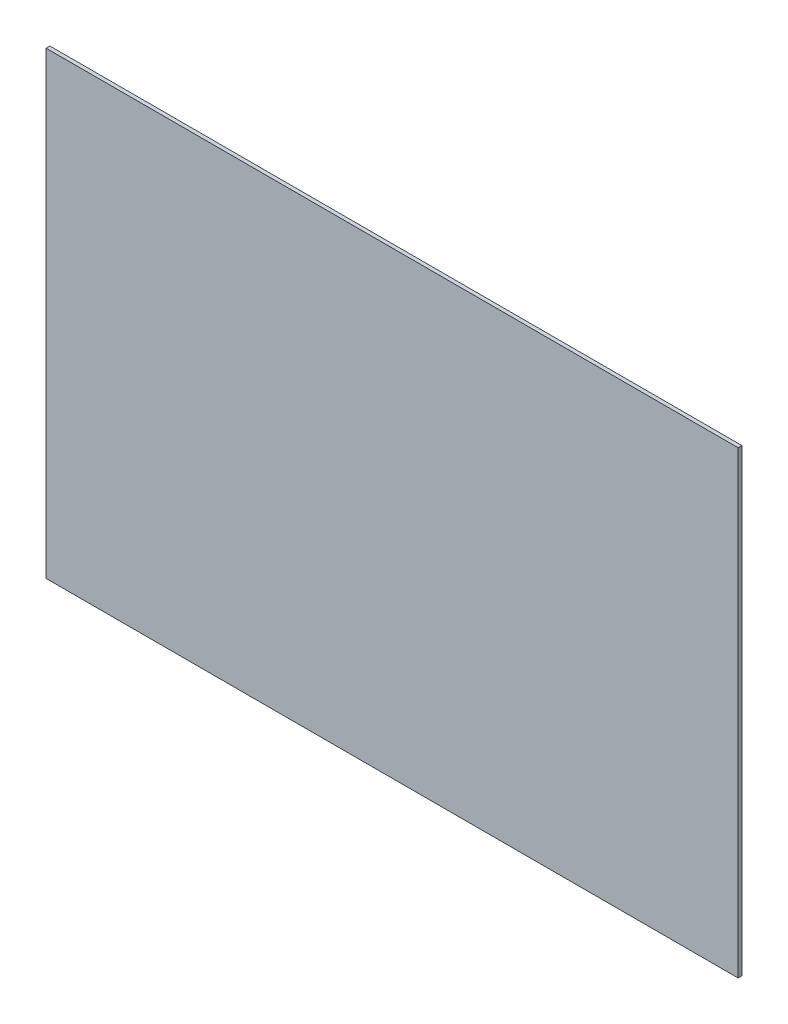
ISO-10303-21;
HEADER;
FILE_DESCRIPTION(('STEP AP214'),'2;1');
FILE_NAME('part.step','',(''),(''),'','','');
FILE_SCHEMA(('AUTOMOTIVE_DESIGN { 1 0 10303 214 1 1 1 1 }'));
ENDSEC;
DATA;
#1=APPLICATION_CONTEXT('core data for automotive mechanical design processes');
#2=APPLICATION_PROTOCOL_DEFINITION('international standard','automotive_design',2000,#1);
#3=PRODUCT_CONTEXT('',#1,'mechanical');
#4=PRODUCT('Part','Part','',(#3));
#5=PRODUCT_RELATED_PRODUCT_CATEGORY('part','',(#4));
#6=PRODUCT_DEFINITION_FORMATION('','',#4);
#7=PRODUCT_DEFINITION_CONTEXT('part definition',#1,'design');
#8=PRODUCT_DEFINITION('design','',#6,#7);
#9=PRODUCT_DEFINITION_SHAPE('','',#8);
#10=(LENGTH_UNIT() NAMED_UNIT(*) SI_UNIT(.MILLI.,.METRE.));
#11=(NAMED_UNIT(*) PLANE_ANGLE_UNIT() SI_UNIT($,.RADIAN.));
#12=(NAMED_UNIT(*) SI_UNIT($,.STERADIAN.) SOLID_ANGLE_UNIT());
#13=UNCERTAINTY_MEASURE_WITH_UNIT(LENGTH_MEASURE(1.E-05),#10,'distance_accuracy_value','');
#14=(GEOMETRIC_REPRESENTATION_CONTEXT(3) GLOBAL_UNCERTAINTY_ASSIGNED_CONTEXT((#13)) GLOBAL_UNIT_ASSIGNED_CONTEXT((#10,
#11,#12)) REPRESENTATION_CONTEXT('',''));
#15=CARTESIAN_POINT('',(0.,0.,0.));
#16=DIRECTION('',(0.,0.,1.));
#17=DIRECTION('',(1.,0.,0.));
#18=AXIS2_PLACEMENT_3D('',#15,#16,#17);
#19=CARTESIAN_POINT('',(-201.936102236422,140.923322683706,3.));
#20=DIRECTION('',(1.,0.,0.));
#21=DIRECTION('',(0.,1.,0.));
#22=AXIS2_PLACEMENT_3D('',#19,#20,#21);
#23=PLANE('',#22);
#24=DIRECTION('',(0.,-1.,0.));
#25=VECTOR('',#24,1.);
#26=CARTESIAN_POINT('',(-201.936102236422,140.923322683706,0.));
#27=LINE('',#26,#25);
#28=CARTESIAN_POINT('',(-201.936102236422,140.923322683706,0.));
#29=VERTEX_POINT('',#28);
#30=CARTESIAN_POINT('',(-201.936102236422,-224.076677316294,0.));
#31=VERTEX_POINT('',#30);
#32=EDGE_CURVE('E96',#29,#31,#27,.T.);
#33=ORIENTED_EDGE('',*,*,#32,.T.);
#34=DIRECTION('',(0.,0.,-1.));
#35=VECTOR('',#34,1.);
#36=CARTESIAN_POINT('',(-201.936102236422,-224.076677316294,3.));
#37=LINE('',#36,#35);
#38=CARTESIAN_POINT('',(-201.936102236422,-224.076677316294,3.));
#39=VERTEX_POINT('',#38);
#40=EDGE_CURVE('E11',#39,#31,#37,.T.);
#41=ORIENTED_EDGE('',*,*,#40,.F.);
#42=DIRECTION('',(0.,-1.,0.));
#43=VECTOR('',#42,1.);
#44=CARTESIAN_POINT('',(-201.936102236422,140.923322683706,3.));
#45=LINE('',#44,#43);
#46=CARTESIAN_POINT('',(-201.936102236422,140.923322683706,3.));
#47=VERTEX_POINT('',#46);
#48=EDGE_CURVE('E84',#47,#39,#45,.T.);
#49=ORIENTED_EDGE('',*,*,#48,.F.);
#50=DIRECTION('',(0.,0.,-1.));
#51=VECTOR('',#50,1.);
#52=CARTESIAN_POINT('',(-201.936102236422,140.923322683706,3.));
#53=LINE('',#52,#51);
#54=EDGE_CURVE('E92',#47,#29,#53,.T.);
#55=ORIENTED_EDGE('',*,*,#54,.T.);
#56=EDGE_LOOP('',(#33,#41,#49,#55));
#57=FACE_BOUND('',#56,.T.);
#58=ADVANCED_FACE('F33',(#57),#23,.F.);
#59=CARTESIAN_POINT('',(-201.936102236422,-224.076677316294,3.));
#60=DIRECTION('',(0.,1.,0.));
#61=DIRECTION('',(0.,0.,1.));
#62=AXIS2_PLACEMENT_3D('',#59,#60,#61);
#63=PLANE('',#62);
#64=DIRECTION('',(1.,0.,0.));
#65=VECTOR('',#64,1.);
#66=CARTESIAN_POINT('',(-201.936102236422,-224.076677316294,0.));
#67=LINE('',#66,#65);
#68=CARTESIAN_POINT('',(348.063897763578,-224.076677316294,0.));
#69=VERTEX_POINT('',#68);
#70=EDGE_CURVE('E88',#31,#69,#67,.T.);
#71=ORIENTED_EDGE('',*,*,#70,.T.);
#72=DIRECTION('',(0.,0.,-1.));
#73=VECTOR('',#72,1.);
#74=CARTESIAN_POINT('',(348.063897763578,-224.076677316294,3.));
#75=LINE('',#74,#73);
#76=CARTESIAN_POINT('',(348.063897763578,-224.076677316294,3.));
#77=VERTEX_POINT('',#76);
#78=EDGE_CURVE('E41',#77,#69,#75,.T.);
#79=ORIENTED_EDGE('',*,*,#78,.F.);
#80=DIRECTION('',(1.,0.,0.));
#81=VECTOR('',#80,1.);
#82=CARTESIAN_POINT('',(-201.936102236422,-224.076677316294,3.));
#83=LINE('',#82,#81);
#84=EDGE_CURVE('E79',#39,#77,#83,.T.);
#85=ORIENTED_EDGE('',*,*,#84,.F.);
#86=ORIENTED_EDGE('',*,*,#40,.T.);
#87=EDGE_LOOP('',(#71,#79,#85,#86));
#88=FACE_BOUND('',#87,.T.);
#89=ADVANCED_FACE('F87',(#88),#63,.F.);
#90=CARTESIAN_POINT('',(348.063897763578,140.923322683706,3.));
#91=DIRECTION('',(-1.,0.,0.));
#92=DIRECTION('',(0.,0.,1.));
#93=AXIS2_PLACEMENT_3D('',#90,#91,#92);
#94=PLANE('',#93);
#95=DIRECTION('',(0.,1.,0.));
#96=VECTOR('',#95,1.);
#97=CARTESIAN_POINT('',(348.063897763578,140.923322683706,0.));
#98=LINE('',#97,#96);
#99=CARTESIAN_POINT('',(348.063897763578,140.923322683706,0.));
#100=VERTEX_POINT('',#99);
#101=EDGE_CURVE('E66',#69,#100,#98,.T.);
#102=ORIENTED_EDGE('',*,*,#101,.T.);
#103=DIRECTION('',(0.,0.,-1.));
#104=VECTOR('',#103,1.);
#105=CARTESIAN_POINT('',(348.063897763578,140.923322683706,3.));
#106=LINE('',#105,#104);
#107=CARTESIAN_POINT('',(348.063897763578,140.923322683706,3.));
#108=VERTEX_POINT('',#107);
#109=EDGE_CURVE('E89',#108,#100,#106,.T.);
#110=ORIENTED_EDGE('',*,*,#109,.F.);
#111=DIRECTION('',(0.,1.,0.));
#112=VECTOR('',#111,1.);
#113=CARTESIAN_POINT('',(348.063897763578,140.923322683706,3.));
#114=LINE('',#113,#112);
#115=EDGE_CURVE('E82',#77,#108,#114,.T.);
#116=ORIENTED_EDGE('',*,*,#115,.F.);
#117=ORIENTED_EDGE('',*,*,#78,.T.);
#118=EDGE_LOOP('',(#102,#110,#116,#117));
#119=FACE_BOUND('',#118,.T.);
#120=ADVANCED_FACE('F90',(#119),#94,.F.);
#121=CARTESIAN_POINT('',(-201.936102236422,140.923322683706,3.));
#122=DIRECTION('',(0.,-1.,0.));
#123=DIRECTION('',(0.,0.,-1.));
#124=AXIS2_PLACEMENT_3D('',#121,#122,#123);
#125=PLANE('',#124);
#126=DIRECTION('',(-1.,0.,0.));
#127=VECTOR('',#126,1.);
#128=CARTESIAN_POINT('',(-201.936102236422,140.923322683706,0.));
#129=LINE('',#128,#127);
#130=EDGE_CURVE('E72',#100,#29,#129,.T.);
#131=ORIENTED_EDGE('',*,*,#130,.T.);
#132=ORIENTED_EDGE('',*,*,#54,.F.);
#133=DIRECTION('',(-1.,0.,0.));
#134=VECTOR('',#133,1.);
#135=CARTESIAN_POINT('',(-201.936102236422,140.923322683706,3.));
#136=LINE('',#135,#134);
#137=EDGE_CURVE('E49',#108,#47,#136,.T.);
#138=ORIENTED_EDGE('',*,*,#137,.F.);
#139=ORIENTED_EDGE('',*,*,#109,.T.);
#140=EDGE_LOOP('',(#131,#132,#138,#139));
#141=FACE_BOUND('',#140,.T.);
#142=ADVANCED_FACE('F103',(#141),#125,.F.);
#143=CARTESIAN_POINT('',(0.,0.,3.));
#144=DIRECTION('',(0.,0.,1.));
#145=DIRECTION('',(1.,0.,0.));
#146=AXIS2_PLACEMENT_3D('',#143,#144,#145);
#147=PLANE('',#146);
#148=ORIENTED_EDGE('',*,*,#48,.T.);
#149=ORIENTED_EDGE('',*,*,#84,.T.);
#150=ORIENTED_EDGE('',*,*,#115,.T.);
#151=ORIENTED_EDGE('',*,*,#137,.T.);
#152=EDGE_LOOP('',(#148,#149,#150,#151));
#153=FACE_BOUND('',#152,.T.);
#154=ADVANCED_FACE('F80',(#153),#147,.T.);
#155=CARTESIAN_POINT('',(0.,0.,0.));
#156=DIRECTION('',(0.,0.,1.));
#157=DIRECTION('',(1.,0.,0.));
#158=AXIS2_PLACEMENT_3D('',#155,#156,#157);
#159=PLANE('',#158);
#160=ORIENTED_EDGE('',*,*,#32,.F.);
#161=ORIENTED_EDGE('',*,*,#130,.F.);
#162=ORIENTED_EDGE('',*,*,#101,.F.);
#163=ORIENTED_EDGE('',*,*,#70,.F.);
#164=EDGE_LOOP('',(#160,#161,#162,#163));
#165=FACE_BOUND('',#164,.T.);
#166=ADVANCED_FACE('F106',(#165),#159,.F.);
#167=CLOSED_SHELL('',(#58,#89,#120,#142,#154,#166));
#168=MANIFOLD_SOLID_BREP('B2',#167);
#169=ADVANCED_BREP_SHAPE_REPRESENTATION('',(#18,#168),#14);
#170=SHAPE_DEFINITION_REPRESENTATION(#9,#169);
ENDSEC;
END-ISO-10303-21;
